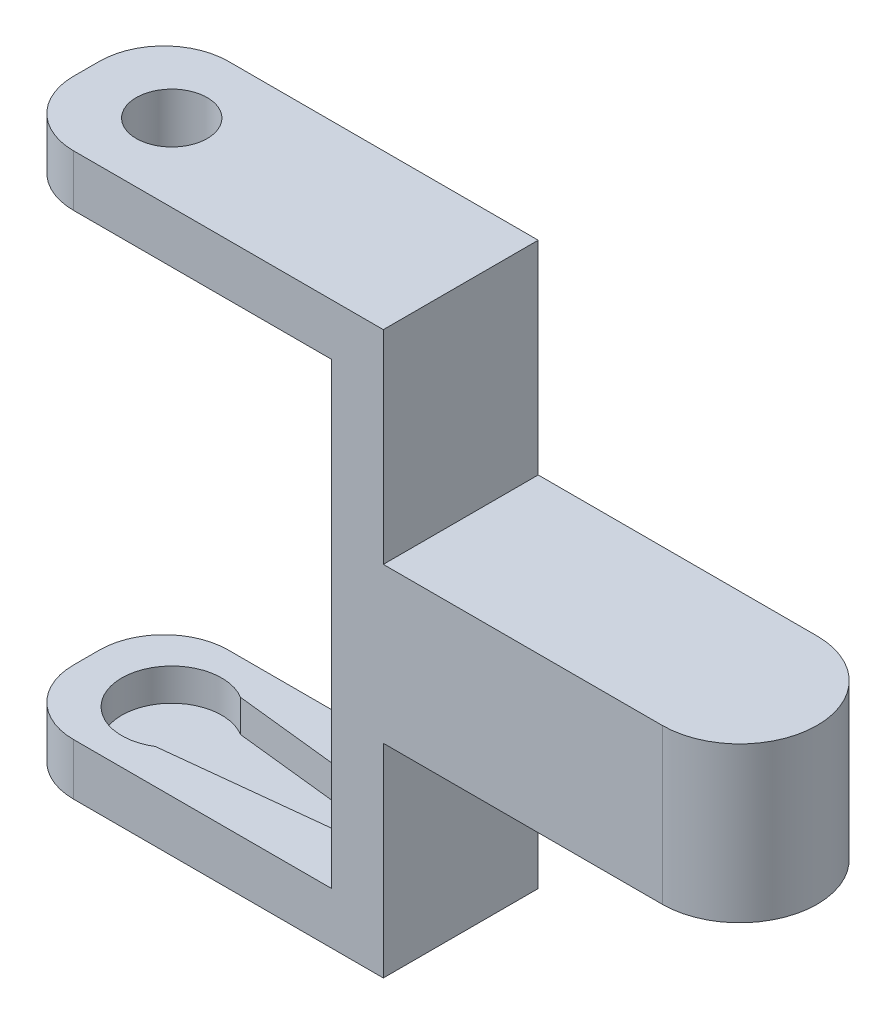
ISO-10303-21;
HEADER;
FILE_DESCRIPTION(('STEP AP214'),'2;1');
FILE_NAME('part.step','',(''),(''),'','','');
FILE_SCHEMA(('AUTOMOTIVE_DESIGN { 1 0 10303 214 1 1 1 1 }'));
ENDSEC;
DATA;
#1=APPLICATION_CONTEXT('core data for automotive mechanical design processes');
#2=APPLICATION_PROTOCOL_DEFINITION('international standard','automotive_design',2000,#1);
#3=PRODUCT_CONTEXT('',#1,'mechanical');
#4=PRODUCT('Part','Part','',(#3));
#5=PRODUCT_RELATED_PRODUCT_CATEGORY('part','',(#4));
#6=PRODUCT_DEFINITION_FORMATION('','',#4);
#7=PRODUCT_DEFINITION_CONTEXT('part definition',#1,'design');
#8=PRODUCT_DEFINITION('design','',#6,#7);
#9=PRODUCT_DEFINITION_SHAPE('','',#8);
#10=(LENGTH_UNIT() NAMED_UNIT(*) SI_UNIT(.MILLI.,.METRE.));
#11=(NAMED_UNIT(*) PLANE_ANGLE_UNIT() SI_UNIT($,.RADIAN.));
#12=(NAMED_UNIT(*) SI_UNIT($,.STERADIAN.) SOLID_ANGLE_UNIT());
#13=UNCERTAINTY_MEASURE_WITH_UNIT(LENGTH_MEASURE(1.E-05),#10,'distance_accuracy_value','');
#14=(GEOMETRIC_REPRESENTATION_CONTEXT(3) GLOBAL_UNCERTAINTY_ASSIGNED_CONTEXT((#13)) GLOBAL_UNIT_ASSIGNED_CONTEXT((#10,
#11,#12)) REPRESENTATION_CONTEXT('',''));
#15=CARTESIAN_POINT('',(0.,0.,0.));
#16=DIRECTION('',(0.,0.,1.));
#17=DIRECTION('',(1.,0.,0.));
#18=AXIS2_PLACEMENT_3D('',#15,#16,#17);
#19=CARTESIAN_POINT('',(44.0008137570343,23.75,0.));
#20=DIRECTION('',(0.,1.,0.));
#21=DIRECTION('',(0.,0.,1.));
#22=AXIS2_PLACEMENT_3D('',#19,#20,#21);
#23=CYLINDRICAL_SURFACE('',#22,6.);
#24=DIRECTION('',(0.,1.,0.));
#25=VECTOR('',#24,1.);
#26=CARTESIAN_POINT('',(44.0008137570343,-4.,-6.));
#27=LINE('',#26,#25);
#28=CARTESIAN_POINT('',(44.0008137570343,23.75,-6.));
#29=VERTEX_POINT('',#28);
#30=CARTESIAN_POINT('',(44.0008137570343,11.75,-6.));
#31=VERTEX_POINT('',#30);
#32=EDGE_CURVE('E175',#29,#31,#27,.F.);
#33=ORIENTED_EDGE('',*,*,#32,.F.);
#34=CARTESIAN_POINT('',(44.0008137570343,23.75,0.));
#35=DIRECTION('',(0.,-1.,0.));
#36=DIRECTION('',(0.,0.,-1.));
#37=AXIS2_PLACEMENT_3D('',#34,#35,#36);
#38=CIRCLE('',#37,6.);
#39=CARTESIAN_POINT('',(44.0008137570343,23.75,6.));
#40=VERTEX_POINT('',#39);
#41=EDGE_CURVE('E43',#40,#29,#38,.F.);
#42=ORIENTED_EDGE('',*,*,#41,.F.);
#43=DIRECTION('',(0.,1.,0.));
#44=VECTOR('',#43,1.);
#45=CARTESIAN_POINT('',(44.0008137570343,-4.,6.));
#46=LINE('',#45,#44);
#47=CARTESIAN_POINT('',(44.0008137570343,11.75,6.));
#48=VERTEX_POINT('',#47);
#49=EDGE_CURVE('E329',#48,#40,#46,.T.);
#50=ORIENTED_EDGE('',*,*,#49,.F.);
#51=CARTESIAN_POINT('',(44.0008137570343,11.75,0.));
#52=DIRECTION('',(0.,1.,0.));
#53=DIRECTION('',(0.,0.,1.));
#54=AXIS2_PLACEMENT_3D('',#51,#52,#53);
#55=CIRCLE('',#54,6.);
#56=EDGE_CURVE('E11',#31,#48,#55,.F.);
#57=ORIENTED_EDGE('',*,*,#56,.F.);
#58=EDGE_LOOP('',(#33,#42,#50,#57));
#59=FACE_BOUND('',#58,.T.);
#60=ADVANCED_FACE('F35',(#59),#23,.T.);
#61=CARTESIAN_POINT('',(22.3908137570343,39.5,6.));
#62=DIRECTION('',(1.,0.,0.));
#63=DIRECTION('',(0.,0.,-1.));
#64=AXIS2_PLACEMENT_3D('',#61,#62,#63);
#65=PLANE('',#64);
#66=DIRECTION('',(0.,0.,1.));
#67=VECTOR('',#66,1.);
#68=CARTESIAN_POINT('',(22.3908137570343,23.75,6.));
#69=LINE('',#68,#67);
#70=CARTESIAN_POINT('',(22.3908137570343,23.75,-6.));
#71=VERTEX_POINT('',#70);
#72=CARTESIAN_POINT('',(22.3908137570343,23.75,6.));
#73=VERTEX_POINT('',#72);
#74=EDGE_CURVE('E193',#71,#73,#69,.T.);
#75=ORIENTED_EDGE('',*,*,#74,.F.);
#76=DIRECTION('',(0.,-1.,0.));
#77=VECTOR('',#76,1.);
#78=CARTESIAN_POINT('',(22.3908137570343,39.5,-6.));
#79=LINE('',#78,#77);
#80=CARTESIAN_POINT('',(22.3908137570343,39.5,-6.));
#81=VERTEX_POINT('',#80);
#82=EDGE_CURVE('E188',#81,#71,#79,.T.);
#83=ORIENTED_EDGE('',*,*,#82,.F.);
#84=DIRECTION('',(0.,0.,1.));
#85=VECTOR('',#84,1.);
#86=CARTESIAN_POINT('',(22.3908137570343,39.5,6.));
#87=LINE('',#86,#85);
#88=CARTESIAN_POINT('',(22.3908137570343,39.5,6.));
#89=VERTEX_POINT('',#88);
#90=EDGE_CURVE('E225',#81,#89,#87,.T.);
#91=ORIENTED_EDGE('',*,*,#90,.T.);
#92=DIRECTION('',(0.,-1.,0.));
#93=VECTOR('',#92,1.);
#94=CARTESIAN_POINT('',(22.3908137570343,39.5,6.));
#95=LINE('',#94,#93);
#96=EDGE_CURVE('E236',#89,#73,#95,.T.);
#97=ORIENTED_EDGE('',*,*,#96,.T.);
#98=EDGE_LOOP('',(#75,#83,#91,#97));
#99=FACE_BOUND('',#98,.T.);
#100=ADVANCED_FACE('F338',(#99),#65,.T.);
#101=CARTESIAN_POINT('',(-6.60918624296569,-4.,-6.));
#102=DIRECTION('',(-1.,0.,0.));
#103=DIRECTION('',(0.,0.,1.));
#104=AXIS2_PLACEMENT_3D('',#101,#102,#103);
#105=PLANE('',#104);
#106=DIRECTION('',(0.,0.,1.));
#107=VECTOR('',#106,1.);
#108=CARTESIAN_POINT('',(-6.60918624296569,-4.,-6.));
#109=LINE('',#108,#107);
#110=CARTESIAN_POINT('',(-6.60918624296569,-4.,-0.999999999999999));
#111=VERTEX_POINT('',#110);
#112=CARTESIAN_POINT('',(-6.60918624296569,-4.,1.));
#113=VERTEX_POINT('',#112);
#114=EDGE_CURVE('E274',#111,#113,#109,.T.);
#115=ORIENTED_EDGE('',*,*,#114,.T.);
#116=DIRECTION('',(0.,1.,0.));
#117=VECTOR('',#116,1.);
#118=CARTESIAN_POINT('',(-6.60918624296569,-4.,1.));
#119=LINE('',#118,#117);
#120=CARTESIAN_POINT('',(-6.60918624296569,0.,1.));
#121=VERTEX_POINT('',#120);
#122=EDGE_CURVE('E317',#113,#121,#119,.T.);
#123=ORIENTED_EDGE('',*,*,#122,.T.);
#124=DIRECTION('',(0.,0.,1.));
#125=VECTOR('',#124,1.);
#126=CARTESIAN_POINT('',(-6.60918624296569,0.,-6.));
#127=LINE('',#126,#125);
#128=CARTESIAN_POINT('',(-6.60918624296569,0.,-0.999999999999999));
#129=VERTEX_POINT('',#128);
#130=EDGE_CURVE('E267',#129,#121,#127,.T.);
#131=ORIENTED_EDGE('',*,*,#130,.F.);
#132=DIRECTION('',(0.,1.,0.));
#133=VECTOR('',#132,1.);
#134=CARTESIAN_POINT('',(-6.60918624296569,-4.,-0.999999999999999));
#135=LINE('',#134,#133);
#136=EDGE_CURVE('E315',#129,#111,#135,.F.);
#137=ORIENTED_EDGE('',*,*,#136,.T.);
#138=EDGE_LOOP('',(#115,#123,#131,#137));
#139=FACE_BOUND('',#138,.T.);
#140=ADVANCED_FACE('F381',(#139),#105,.T.);
#141=CARTESIAN_POINT('',(-6.60918624296569,-4.,-6.));
#142=DIRECTION('',(0.,0.,-1.));
#143=DIRECTION('',(-1.,0.,0.));
#144=AXIS2_PLACEMENT_3D('',#141,#142,#143);
#145=PLANE('',#144);
#146=DIRECTION('',(-1.,0.,0.));
#147=VECTOR('',#146,1.);
#148=CARTESIAN_POINT('',(50.0008137570343,23.75,-6.));
#149=LINE('',#148,#147);
#150=EDGE_CURVE('E178',#29,#71,#149,.T.);
#151=ORIENTED_EDGE('',*,*,#150,.F.);
#152=ORIENTED_EDGE('',*,*,#32,.T.);
#153=DIRECTION('',(-1.,0.,0.));
#154=VECTOR('',#153,1.);
#155=CARTESIAN_POINT('',(50.0008137570343,11.75,-6.));
#156=LINE('',#155,#154);
#157=CARTESIAN_POINT('',(22.3908137570343,11.75,-6.));
#158=VERTEX_POINT('',#157);
#159=EDGE_CURVE('E168',#31,#158,#156,.T.);
#160=ORIENTED_EDGE('',*,*,#159,.T.);
#161=CARTESIAN_POINT('',(22.3908137570343,-4.,-6.));
#162=VERTEX_POINT('',#161);
#163=EDGE_CURVE('E173',#158,#162,#79,.T.);
#164=ORIENTED_EDGE('',*,*,#163,.T.);
#165=DIRECTION('',(-1.,0.,0.));
#166=VECTOR('',#165,1.);
#167=CARTESIAN_POINT('',(-6.60918624296569,-4.,-6.));
#168=LINE('',#167,#166);
#169=CARTESIAN_POINT('',(-1.60918624296569,-4.,-6.));
#170=VERTEX_POINT('',#169);
#171=EDGE_CURVE('E281',#162,#170,#168,.T.);
#172=ORIENTED_EDGE('',*,*,#171,.T.);
#173=DIRECTION('',(0.,1.,0.));
#174=VECTOR('',#173,1.);
#175=CARTESIAN_POINT('',(-1.60918624296569,-4.,-6.));
#176=LINE('',#175,#174);
#177=CARTESIAN_POINT('',(-1.60918624296569,0.,-6.));
#178=VERTEX_POINT('',#177);
#179=EDGE_CURVE('E309',#170,#178,#176,.T.);
#180=ORIENTED_EDGE('',*,*,#179,.T.);
#181=DIRECTION('',(-1.,0.,0.));
#182=VECTOR('',#181,1.);
#183=CARTESIAN_POINT('',(-6.60918624296569,0.,-6.));
#184=LINE('',#183,#182);
#185=CARTESIAN_POINT('',(18.3908137570343,0.,-6.));
#186=VERTEX_POINT('',#185);
#187=EDGE_CURVE('E278',#186,#178,#184,.T.);
#188=ORIENTED_EDGE('',*,*,#187,.F.);
#189=DIRECTION('',(0.,-1.,0.));
#190=VECTOR('',#189,1.);
#191=CARTESIAN_POINT('',(18.3908137570343,39.5,-6.));
#192=LINE('',#191,#190);
#193=CARTESIAN_POINT('',(18.3908137570343,35.5,-6.));
#194=VERTEX_POINT('',#193);
#195=EDGE_CURVE('E189',#194,#186,#192,.T.);
#196=ORIENTED_EDGE('',*,*,#195,.F.);
#197=DIRECTION('',(-1.,0.,0.));
#198=VECTOR('',#197,1.);
#199=CARTESIAN_POINT('',(18.3908137570343,35.5,-6.));
#200=LINE('',#199,#198);
#201=CARTESIAN_POINT('',(-1.60918624296568,35.5,-6.));
#202=VERTEX_POINT('',#201);
#203=EDGE_CURVE('E218',#194,#202,#200,.T.);
#204=ORIENTED_EDGE('',*,*,#203,.T.);
#205=DIRECTION('',(0.,1.,0.));
#206=VECTOR('',#205,1.);
#207=CARTESIAN_POINT('',(-1.60918624296569,-4.,-6.));
#208=LINE('',#207,#206);
#209=CARTESIAN_POINT('',(-1.60918624296568,39.5,-6.));
#210=VERTEX_POINT('',#209);
#211=EDGE_CURVE('E312',#202,#210,#208,.T.);
#212=ORIENTED_EDGE('',*,*,#211,.T.);
#213=DIRECTION('',(1.,0.,0.));
#214=VECTOR('',#213,1.);
#215=CARTESIAN_POINT('',(18.3908137570343,39.5,-6.));
#216=LINE('',#215,#214);
#217=EDGE_CURVE('E223',#210,#81,#216,.T.);
#218=ORIENTED_EDGE('',*,*,#217,.T.);
#219=ORIENTED_EDGE('',*,*,#82,.T.);
#220=EDGE_LOOP('',(#151,#152,#160,#164,#172,#180,#188,#196,#204,#212,#218,#219));
#221=FACE_BOUND('',#220,.T.);
#222=ADVANCED_FACE('F171',(#221),#145,.T.);
#223=CARTESIAN_POINT('',(-6.60918624296569,-4.,6.));
#224=DIRECTION('',(0.,0.,1.));
#225=DIRECTION('',(1.,0.,0.));
#226=AXIS2_PLACEMENT_3D('',#223,#224,#225);
#227=PLANE('',#226);
#228=DIRECTION('',(-1.,0.,0.));
#229=VECTOR('',#228,1.);
#230=CARTESIAN_POINT('',(50.0008137570343,11.75,6.));
#231=LINE('',#230,#229);
#232=CARTESIAN_POINT('',(22.3908137570343,11.75,6.));
#233=VERTEX_POINT('',#232);
#234=EDGE_CURVE('E177',#48,#233,#231,.T.);
#235=ORIENTED_EDGE('',*,*,#234,.F.);
#236=ORIENTED_EDGE('',*,*,#49,.T.);
#237=DIRECTION('',(-1.,0.,0.));
#238=VECTOR('',#237,1.);
#239=CARTESIAN_POINT('',(50.0008137570343,23.75,6.));
#240=LINE('',#239,#238);
#241=EDGE_CURVE('E196',#40,#73,#240,.T.);
#242=ORIENTED_EDGE('',*,*,#241,.T.);
#243=ORIENTED_EDGE('',*,*,#96,.F.);
#244=DIRECTION('',(-1.,0.,0.));
#245=VECTOR('',#244,1.);
#246=CARTESIAN_POINT('',(18.3908137570343,39.5,6.));
#247=LINE('',#246,#245);
#248=CARTESIAN_POINT('',(-1.60918624296568,39.5,6.));
#249=VERTEX_POINT('',#248);
#250=EDGE_CURVE('E228',#89,#249,#247,.T.);
#251=ORIENTED_EDGE('',*,*,#250,.T.);
#252=DIRECTION('',(0.,1.,0.));
#253=VECTOR('',#252,1.);
#254=CARTESIAN_POINT('',(-1.60918624296569,-4.,6.));
#255=LINE('',#254,#253);
#256=CARTESIAN_POINT('',(-1.60918624296568,35.5,6.));
#257=VERTEX_POINT('',#256);
#258=EDGE_CURVE('E303',#249,#257,#255,.F.);
#259=ORIENTED_EDGE('',*,*,#258,.T.);
#260=DIRECTION('',(-1.,0.,0.));
#261=VECTOR('',#260,1.);
#262=CARTESIAN_POINT('',(18.3908137570343,35.5,6.));
#263=LINE('',#262,#261);
#264=CARTESIAN_POINT('',(18.3908137570343,35.5,6.));
#265=VERTEX_POINT('',#264);
#266=EDGE_CURVE('E212',#265,#257,#263,.T.);
#267=ORIENTED_EDGE('',*,*,#266,.F.);
#268=DIRECTION('',(0.,-1.,0.));
#269=VECTOR('',#268,1.);
#270=CARTESIAN_POINT('',(18.3908137570343,39.5,6.));
#271=LINE('',#270,#269);
#272=CARTESIAN_POINT('',(18.3908137570343,0.,6.));
#273=VERTEX_POINT('',#272);
#274=EDGE_CURVE('E232',#265,#273,#271,.T.);
#275=ORIENTED_EDGE('',*,*,#274,.T.);
#276=DIRECTION('',(1.,0.,0.));
#277=VECTOR('',#276,1.);
#278=CARTESIAN_POINT('',(-6.60918624296569,0.,6.));
#279=LINE('',#278,#277);
#280=CARTESIAN_POINT('',(-1.60918624296569,0.,6.));
#281=VERTEX_POINT('',#280);
#282=EDGE_CURVE('E286',#281,#273,#279,.T.);
#283=ORIENTED_EDGE('',*,*,#282,.F.);
#284=DIRECTION('',(0.,1.,0.));
#285=VECTOR('',#284,1.);
#286=CARTESIAN_POINT('',(-1.60918624296569,-4.,6.));
#287=LINE('',#286,#285);
#288=CARTESIAN_POINT('',(-1.60918624296569,-4.,6.));
#289=VERTEX_POINT('',#288);
#290=EDGE_CURVE('E301',#281,#289,#287,.F.);
#291=ORIENTED_EDGE('',*,*,#290,.T.);
#292=DIRECTION('',(1.,0.,0.));
#293=VECTOR('',#292,1.);
#294=CARTESIAN_POINT('',(-6.60918624296569,-4.,6.));
#295=LINE('',#294,#293);
#296=CARTESIAN_POINT('',(22.3908137570343,-4.,6.));
#297=VERTEX_POINT('',#296);
#298=EDGE_CURVE('E277',#289,#297,#295,.T.);
#299=ORIENTED_EDGE('',*,*,#298,.T.);
#300=EDGE_CURVE('E238',#233,#297,#95,.T.);
#301=ORIENTED_EDGE('',*,*,#300,.F.);
#302=EDGE_LOOP('',(#235,#236,#242,#243,#251,#259,#267,#275,#283,#291,#299,#301));
#303=FACE_BOUND('',#302,.T.);
#304=ADVANCED_FACE('F344',(#303),#227,.T.);
#305=CARTESIAN_POINT('',(0.,-4.,0.));
#306=DIRECTION('',(0.,1.,0.));
#307=DIRECTION('',(0.,0.,1.));
#308=AXIS2_PLACEMENT_3D('',#305,#306,#307);
#309=PLANE('',#308);
#310=ORIENTED_EDGE('',*,*,#298,.F.);
#311=CARTESIAN_POINT('',(-1.60918624296569,-4.,1.));
#312=DIRECTION('',(0.,1.,0.));
#313=DIRECTION('',(0.,0.,1.));
#314=AXIS2_PLACEMENT_3D('',#311,#312,#313);
#315=CIRCLE('',#314,5.);
#316=EDGE_CURVE('E326',#289,#113,#315,.F.);
#317=ORIENTED_EDGE('',*,*,#316,.T.);
#318=ORIENTED_EDGE('',*,*,#114,.F.);
#319=CARTESIAN_POINT('',(-1.60918624296569,-4.,-1.));
#320=DIRECTION('',(0.,1.,0.));
#321=DIRECTION('',(0.,0.,1.));
#322=AXIS2_PLACEMENT_3D('',#319,#320,#321);
#323=CIRCLE('',#322,5.);
#324=EDGE_CURVE('E324',#111,#170,#323,.F.);
#325=ORIENTED_EDGE('',*,*,#324,.T.);
#326=ORIENTED_EDGE('',*,*,#171,.F.);
#327=DIRECTION('',(0.,0.,1.));
#328=VECTOR('',#327,1.);
#329=CARTESIAN_POINT('',(22.3908137570343,-4.,6.));
#330=LINE('',#329,#328);
#331=EDGE_CURVE('E187',#162,#297,#330,.T.);
#332=ORIENTED_EDGE('',*,*,#331,.T.);
#333=EDGE_LOOP('',(#310,#317,#318,#325,#326,#332));
#334=FACE_BOUND('',#333,.T.);
#335=ADVANCED_FACE('F378',(#334),#309,.F.);
#336=CARTESIAN_POINT('',(0.,0.,0.));
#337=DIRECTION('',(0.,1.,0.));
#338=DIRECTION('',(0.,0.,1.));
#339=AXIS2_PLACEMENT_3D('',#336,#337,#338);
#340=PLANE('',#339);
#341=CARTESIAN_POINT('',(14.254126853945,0.,0.));
#342=DIRECTION('',(0.,1.,0.));
#343=DIRECTION('',(0.,0.,1.));
#344=AXIS2_PLACEMENT_3D('',#341,#342,#343);
#345=CIRCLE('',#344,1.96240815597465);
#346=CARTESIAN_POINT('',(14.254126853945,0.,1.96240815597465));
#347=VERTEX_POINT('',#346);
#348=CARTESIAN_POINT('',(14.254126853945,0.,-1.96240815597465));
#349=VERTEX_POINT('',#348);
#350=EDGE_CURVE('E235',#347,#349,#345,.T.);
#351=ORIENTED_EDGE('',*,*,#350,.F.);
#352=DIRECTION('',(0.994069597814504,0.,-0.108745734173391));
#353=VECTOR('',#352,1.);
#354=CARTESIAN_POINT('',(14.254126853945,0.,1.96240815597465));
#355=LINE('',#354,#353);
#356=CARTESIAN_POINT('',(2.0290903736251,0.,3.29975975617614));
#357=VERTEX_POINT('',#356);
#358=EDGE_CURVE('E246',#357,#347,#355,.T.);
#359=ORIENTED_EDGE('',*,*,#358,.F.);
#360=CARTESIAN_POINT('',(0.,0.,0.));
#361=DIRECTION('',(0.,1.,0.));
#362=DIRECTION('',(0.,0.,1.));
#363=AXIS2_PLACEMENT_3D('',#360,#361,#362);
#364=CIRCLE('',#363,3.87370910018004);
#365=CARTESIAN_POINT('',(2.0290903736251,0.,-3.29975975617614));
#366=VERTEX_POINT('',#365);
#367=EDGE_CURVE('E260',#366,#357,#364,.T.);
#368=ORIENTED_EDGE('',*,*,#367,.F.);
#369=DIRECTION('',(-0.994069597814504,0.,-0.108745734173391));
#370=VECTOR('',#369,1.);
#371=CARTESIAN_POINT('',(14.254126853945,0.,-1.96240815597465));
#372=LINE('',#371,#370);
#373=EDGE_CURVE('E257',#349,#366,#372,.T.);
#374=ORIENTED_EDGE('',*,*,#373,.F.);
#375=EDGE_LOOP('',(#351,#359,#368,#374));
#376=FACE_BOUND('',#375,.T.);
#377=ORIENTED_EDGE('',*,*,#130,.T.);
#378=CARTESIAN_POINT('',(-1.60918624296569,0.,1.));
#379=DIRECTION('',(0.,1.,0.));
#380=DIRECTION('',(0.,0.,1.));
#381=AXIS2_PLACEMENT_3D('',#378,#379,#380);
#382=CIRCLE('',#381,5.);
#383=EDGE_CURVE('E322',#121,#281,#382,.T.);
#384=ORIENTED_EDGE('',*,*,#383,.T.);
#385=ORIENTED_EDGE('',*,*,#282,.T.);
#386=DIRECTION('',(0.,0.,-1.));
#387=VECTOR('',#386,1.);
#388=CARTESIAN_POINT('',(18.3908137570343,0.,-6.));
#389=LINE('',#388,#387);
#390=EDGE_CURVE('E288',#273,#186,#389,.T.);
#391=ORIENTED_EDGE('',*,*,#390,.T.);
#392=ORIENTED_EDGE('',*,*,#187,.T.);
#393=CARTESIAN_POINT('',(-1.60918624296569,0.,-1.));
#394=DIRECTION('',(0.,1.,0.));
#395=DIRECTION('',(0.,0.,1.));
#396=AXIS2_PLACEMENT_3D('',#393,#394,#395);
#397=CIRCLE('',#396,5.);
#398=EDGE_CURVE('E320',#178,#129,#397,.T.);
#399=ORIENTED_EDGE('',*,*,#398,.T.);
#400=EDGE_LOOP('',(#377,#384,#385,#391,#392,#399));
#401=FACE_BOUND('',#400,.T.);
#402=ADVANCED_FACE('F368',(#376,#401),#340,.T.);
#403=CARTESIAN_POINT('',(14.254126853945,-2.5,0.));
#404=DIRECTION('',(0.,1.,0.));
#405=DIRECTION('',(0.,0.,1.));
#406=AXIS2_PLACEMENT_3D('',#403,#404,#405);
#407=CYLINDRICAL_SURFACE('',#406,1.96240815597465);
#408=ORIENTED_EDGE('',*,*,#350,.T.);
#409=DIRECTION('',(0.,1.,0.));
#410=VECTOR('',#409,1.);
#411=CARTESIAN_POINT('',(14.254126853945,-2.5,-1.96240815597465));
#412=LINE('',#411,#410);
#413=CARTESIAN_POINT('',(14.254126853945,-2.5,-1.96240815597465));
#414=VERTEX_POINT('',#413);
#415=EDGE_CURVE('E255',#414,#349,#412,.T.);
#416=ORIENTED_EDGE('',*,*,#415,.F.);
#417=CARTESIAN_POINT('',(14.254126853945,-2.5,0.));
#418=DIRECTION('',(0.,1.,0.));
#419=DIRECTION('',(0.,0.,1.));
#420=AXIS2_PLACEMENT_3D('',#417,#418,#419);
#421=CIRCLE('',#420,1.96240815597465);
#422=CARTESIAN_POINT('',(14.254126853945,-2.5,1.96240815597465));
#423=VERTEX_POINT('',#422);
#424=EDGE_CURVE('E242',#423,#414,#421,.T.);
#425=ORIENTED_EDGE('',*,*,#424,.F.);
#426=DIRECTION('',(0.,1.,0.));
#427=VECTOR('',#426,1.);
#428=CARTESIAN_POINT('',(14.254126853945,-2.5,1.96240815597465));
#429=LINE('',#428,#427);
#430=EDGE_CURVE('E265',#423,#347,#429,.T.);
#431=ORIENTED_EDGE('',*,*,#430,.T.);
#432=EDGE_LOOP('',(#408,#416,#425,#431));
#433=FACE_BOUND('',#432,.T.);
#434=ADVANCED_FACE('F423',(#433),#407,.F.);
#435=CARTESIAN_POINT('',(14.254126853945,-2.5,1.96240815597465));
#436=DIRECTION('',(0.108745734173391,0.,0.994069597814504));
#437=DIRECTION('',(0.994069597814504,0.,-0.108745734173391));
#438=AXIS2_PLACEMENT_3D('',#435,#436,#437);
#439=PLANE('',#438);
#440=ORIENTED_EDGE('',*,*,#358,.T.);
#441=ORIENTED_EDGE('',*,*,#430,.F.);
#442=DIRECTION('',(0.994069597814504,0.,-0.108745734173391));
#443=VECTOR('',#442,1.);
#444=CARTESIAN_POINT('',(14.254126853945,-2.5,1.96240815597465));
#445=LINE('',#444,#443);
#446=CARTESIAN_POINT('',(2.0290903736251,-2.5,3.29975975617614));
#447=VERTEX_POINT('',#446);
#448=EDGE_CURVE('E252',#447,#423,#445,.T.);
#449=ORIENTED_EDGE('',*,*,#448,.F.);
#450=DIRECTION('',(0.,1.,0.));
#451=VECTOR('',#450,1.);
#452=CARTESIAN_POINT('',(2.0290903736251,-2.5,3.29975975617614));
#453=LINE('',#452,#451);
#454=EDGE_CURVE('E268',#447,#357,#453,.T.);
#455=ORIENTED_EDGE('',*,*,#454,.T.);
#456=EDGE_LOOP('',(#440,#441,#449,#455));
#457=FACE_BOUND('',#456,.T.);
#458=ADVANCED_FACE('F419',(#457),#439,.F.);
#459=CARTESIAN_POINT('',(0.,-2.5,0.));
#460=DIRECTION('',(0.,1.,0.));
#461=DIRECTION('',(0.,0.,1.));
#462=AXIS2_PLACEMENT_3D('',#459,#460,#461);
#463=CYLINDRICAL_SURFACE('',#462,3.87370910018004);
#464=ORIENTED_EDGE('',*,*,#367,.T.);
#465=ORIENTED_EDGE('',*,*,#454,.F.);
#466=CARTESIAN_POINT('',(0.,-2.5,0.));
#467=DIRECTION('',(0.,1.,0.));
#468=DIRECTION('',(0.,0.,1.));
#469=AXIS2_PLACEMENT_3D('',#466,#467,#468);
#470=CIRCLE('',#469,3.87370910018004);
#471=CARTESIAN_POINT('',(2.0290903736251,-2.5,-3.29975975617614));
#472=VERTEX_POINT('',#471);
#473=EDGE_CURVE('E249',#472,#447,#470,.T.);
#474=ORIENTED_EDGE('',*,*,#473,.F.);
#475=DIRECTION('',(0.,1.,0.));
#476=VECTOR('',#475,1.);
#477=CARTESIAN_POINT('',(2.0290903736251,-2.5,-3.29975975617614));
#478=LINE('',#477,#476);
#479=EDGE_CURVE('E270',#472,#366,#478,.T.);
#480=ORIENTED_EDGE('',*,*,#479,.T.);
#481=EDGE_LOOP('',(#464,#465,#474,#480));
#482=FACE_BOUND('',#481,.T.);
#483=ADVANCED_FACE('F422',(#482),#463,.F.);
#484=CARTESIAN_POINT('',(14.254126853945,-2.5,-1.96240815597465));
#485=DIRECTION('',(0.108745734173391,0.,-0.994069597814504));
#486=DIRECTION('',(-0.994069597814504,0.,-0.108745734173391));
#487=AXIS2_PLACEMENT_3D('',#484,#485,#486);
#488=PLANE('',#487);
#489=ORIENTED_EDGE('',*,*,#373,.T.);
#490=ORIENTED_EDGE('',*,*,#479,.F.);
#491=DIRECTION('',(-0.994069597814504,0.,-0.108745734173391));
#492=VECTOR('',#491,1.);
#493=CARTESIAN_POINT('',(14.254126853945,-2.5,-1.96240815597465));
#494=LINE('',#493,#492);
#495=EDGE_CURVE('E245',#414,#472,#494,.T.);
#496=ORIENTED_EDGE('',*,*,#495,.F.);
#497=ORIENTED_EDGE('',*,*,#415,.T.);
#498=EDGE_LOOP('',(#489,#490,#496,#497));
#499=FACE_BOUND('',#498,.T.);
#500=ADVANCED_FACE('F415',(#499),#488,.F.);
#501=CARTESIAN_POINT('',(14.254126853945,-2.5,0.));
#502=DIRECTION('',(0.,1.,0.));
#503=DIRECTION('',(0.,0.,1.));
#504=AXIS2_PLACEMENT_3D('',#501,#502,#503);
#505=PLANE('',#504);
#506=ORIENTED_EDGE('',*,*,#424,.T.);
#507=ORIENTED_EDGE('',*,*,#495,.T.);
#508=ORIENTED_EDGE('',*,*,#473,.T.);
#509=ORIENTED_EDGE('',*,*,#448,.T.);
#510=EDGE_LOOP('',(#506,#507,#508,#509));
#511=FACE_BOUND('',#510,.T.);
#512=ADVANCED_FACE('F411',(#511),#505,.T.);
#513=CARTESIAN_POINT('',(18.3908137570343,39.5,6.));
#514=DIRECTION('',(-1.,0.,0.));
#515=DIRECTION('',(0.,0.,1.));
#516=AXIS2_PLACEMENT_3D('',#513,#514,#515);
#517=PLANE('',#516);
#518=DIRECTION('',(0.,0.,1.));
#519=VECTOR('',#518,1.);
#520=CARTESIAN_POINT('',(18.3908137570343,35.5,-6.));
#521=LINE('',#520,#519);
#522=EDGE_CURVE('E209',#194,#265,#521,.T.);
#523=ORIENTED_EDGE('',*,*,#522,.F.);
#524=ORIENTED_EDGE('',*,*,#195,.T.);
#525=ORIENTED_EDGE('',*,*,#390,.F.);
#526=ORIENTED_EDGE('',*,*,#274,.F.);
#527=EDGE_LOOP('',(#523,#524,#525,#526));
#528=FACE_BOUND('',#527,.T.);
#529=ADVANCED_FACE('F366',(#528),#517,.T.);
#530=DIRECTION('',(0.,0.,-1.));
#531=VECTOR('',#530,1.);
#532=CARTESIAN_POINT('',(22.3908137570343,11.75,6.));
#533=LINE('',#532,#531);
#534=EDGE_CURVE('E184',#233,#158,#533,.T.);
#535=ORIENTED_EDGE('',*,*,#534,.F.);
#536=ORIENTED_EDGE('',*,*,#300,.T.);
#537=ORIENTED_EDGE('',*,*,#331,.F.);
#538=ORIENTED_EDGE('',*,*,#163,.F.);
#539=EDGE_LOOP('',(#535,#536,#537,#538));
#540=FACE_BOUND('',#539,.T.);
#541=ADVANCED_FACE('F183',(#540),#65,.T.);
#542=CARTESIAN_POINT('',(0.,39.5,0.));
#543=DIRECTION('',(0.,-1.,0.));
#544=DIRECTION('',(0.,0.,-1.));
#545=AXIS2_PLACEMENT_3D('',#542,#543,#544);
#546=PLANE('',#545);
#547=CARTESIAN_POINT('',(0.,39.5,0.));
#548=DIRECTION('',(0.,1.,0.));
#549=DIRECTION('',(0.,0.,1.));
#550=AXIS2_PLACEMENT_3D('',#547,#548,#549);
#551=CIRCLE('',#550,2.75);
#552=CARTESIAN_POINT('',(0.,39.5,2.75));
#553=VERTEX_POINT('',#552);
#554=EDGE_CURVE('E202',#553,#553,#551,.T.);
#555=ORIENTED_EDGE('',*,*,#554,.F.);
#556=EDGE_LOOP('',(#555));
#557=FACE_BOUND('',#556,.T.);
#558=DIRECTION('',(0.,0.,1.));
#559=VECTOR('',#558,1.);
#560=CARTESIAN_POINT('',(-6.60918624296569,39.5,-6.));
#561=LINE('',#560,#559);
#562=CARTESIAN_POINT('',(-6.60918624296569,39.5,-1.));
#563=VERTEX_POINT('',#562);
#564=CARTESIAN_POINT('',(-6.60918624296569,39.5,1.));
#565=VERTEX_POINT('',#564);
#566=EDGE_CURVE('E206',#563,#565,#561,.T.);
#567=ORIENTED_EDGE('',*,*,#566,.T.);
#568=CARTESIAN_POINT('',(-1.60918624296569,39.5,1.));
#569=DIRECTION('',(0.,-1.,0.));
#570=DIRECTION('',(0.,0.,-1.));
#571=AXIS2_PLACEMENT_3D('',#568,#569,#570);
#572=CIRCLE('',#571,5.);
#573=EDGE_CURVE('E299',#565,#249,#572,.F.);
#574=ORIENTED_EDGE('',*,*,#573,.T.);
#575=ORIENTED_EDGE('',*,*,#250,.F.);
#576=ORIENTED_EDGE('',*,*,#90,.F.);
#577=ORIENTED_EDGE('',*,*,#217,.F.);
#578=CARTESIAN_POINT('',(-1.60918624296569,39.5,-1.));
#579=DIRECTION('',(0.,-1.,0.));
#580=DIRECTION('',(0.,0.,-1.));
#581=AXIS2_PLACEMENT_3D('',#578,#579,#580);
#582=CIRCLE('',#581,5.);
#583=EDGE_CURVE('E297',#210,#563,#582,.F.);
#584=ORIENTED_EDGE('',*,*,#583,.T.);
#585=EDGE_LOOP('',(#567,#574,#575,#576,#577,#584));
#586=FACE_BOUND('',#585,.T.);
#587=ADVANCED_FACE('F341',(#557,#586),#546,.F.);
#588=CARTESIAN_POINT('',(-6.60918624296569,35.5,-6.));
#589=DIRECTION('',(-1.,0.,0.));
#590=DIRECTION('',(0.,0.,1.));
#591=AXIS2_PLACEMENT_3D('',#588,#589,#590);
#592=PLANE('',#591);
#593=DIRECTION('',(0.,0.,1.));
#594=VECTOR('',#593,1.);
#595=CARTESIAN_POINT('',(-6.60918624296569,35.5,-6.));
#596=LINE('',#595,#594);
#597=CARTESIAN_POINT('',(-6.60918624296569,35.5,-1.));
#598=VERTEX_POINT('',#597);
#599=CARTESIAN_POINT('',(-6.60918624296569,35.5,1.));
#600=VERTEX_POINT('',#599);
#601=EDGE_CURVE('E215',#598,#600,#596,.T.);
#602=ORIENTED_EDGE('',*,*,#601,.T.);
#603=DIRECTION('',(0.,1.,0.));
#604=VECTOR('',#603,1.);
#605=CARTESIAN_POINT('',(-6.60918624296569,35.5,1.));
#606=LINE('',#605,#604);
#607=EDGE_CURVE('E294',#600,#565,#606,.T.);
#608=ORIENTED_EDGE('',*,*,#607,.T.);
#609=ORIENTED_EDGE('',*,*,#566,.F.);
#610=DIRECTION('',(0.,1.,0.));
#611=VECTOR('',#610,1.);
#612=CARTESIAN_POINT('',(-6.60918624296569,35.5,-1.));
#613=LINE('',#612,#611);
#614=EDGE_CURVE('E283',#563,#598,#613,.F.);
#615=ORIENTED_EDGE('',*,*,#614,.T.);
#616=EDGE_LOOP('',(#602,#608,#609,#615));
#617=FACE_BOUND('',#616,.T.);
#618=ADVANCED_FACE('F355',(#617),#592,.T.);
#619=CARTESIAN_POINT('',(0.,35.5,0.));
#620=DIRECTION('',(0.,-1.,0.));
#621=DIRECTION('',(0.,0.,-1.));
#622=AXIS2_PLACEMENT_3D('',#619,#620,#621);
#623=PLANE('',#622);
#624=CARTESIAN_POINT('',(0.,35.5,0.));
#625=DIRECTION('',(0.,1.,0.));
#626=DIRECTION('',(0.,0.,1.));
#627=AXIS2_PLACEMENT_3D('',#624,#625,#626);
#628=CIRCLE('',#627,2.75);
#629=CARTESIAN_POINT('',(0.,35.5,2.75));
#630=VERTEX_POINT('',#629);
#631=EDGE_CURVE('E203',#630,#630,#628,.T.);
#632=ORIENTED_EDGE('',*,*,#631,.T.);
#633=EDGE_LOOP('',(#632));
#634=FACE_BOUND('',#633,.T.);
#635=ORIENTED_EDGE('',*,*,#266,.T.);
#636=CARTESIAN_POINT('',(-1.60918624296569,35.5,1.));
#637=DIRECTION('',(0.,-1.,0.));
#638=DIRECTION('',(0.,0.,-1.));
#639=AXIS2_PLACEMENT_3D('',#636,#637,#638);
#640=CIRCLE('',#639,5.);
#641=EDGE_CURVE('E307',#257,#600,#640,.T.);
#642=ORIENTED_EDGE('',*,*,#641,.T.);
#643=ORIENTED_EDGE('',*,*,#601,.F.);
#644=CARTESIAN_POINT('',(-1.60918624296569,35.5,-1.));
#645=DIRECTION('',(0.,-1.,0.));
#646=DIRECTION('',(0.,0.,-1.));
#647=AXIS2_PLACEMENT_3D('',#644,#645,#646);
#648=CIRCLE('',#647,5.);
#649=EDGE_CURVE('E305',#598,#202,#648,.T.);
#650=ORIENTED_EDGE('',*,*,#649,.T.);
#651=ORIENTED_EDGE('',*,*,#203,.F.);
#652=ORIENTED_EDGE('',*,*,#522,.T.);
#653=EDGE_LOOP('',(#635,#642,#643,#650,#651,#652));
#654=FACE_BOUND('',#653,.T.);
#655=ADVANCED_FACE('F352',(#634,#654),#623,.T.);
#656=CARTESIAN_POINT('',(0.,35.5,0.));
#657=DIRECTION('',(0.,1.,0.));
#658=DIRECTION('',(0.,0.,1.));
#659=AXIS2_PLACEMENT_3D('',#656,#657,#658);
#660=CYLINDRICAL_SURFACE('',#659,2.75);
#661=ORIENTED_EDGE('',*,*,#631,.F.);
#662=EDGE_LOOP('',(#661));
#663=FACE_BOUND('',#662,.T.);
#664=ORIENTED_EDGE('',*,*,#554,.T.);
#665=EDGE_LOOP('',(#664));
#666=FACE_BOUND('',#665,.T.);
#667=ADVANCED_FACE('F445',(#663,#666),#660,.F.);
#668=CARTESIAN_POINT('',(-1.60918624296569,35.5,1.));
#669=DIRECTION('',(0.,1.,0.));
#670=DIRECTION('',(0.,0.,1.));
#671=AXIS2_PLACEMENT_3D('',#668,#669,#670);
#672=CYLINDRICAL_SURFACE('',#671,5.);
#673=ORIENTED_EDGE('',*,*,#641,.F.);
#674=ORIENTED_EDGE('',*,*,#258,.F.);
#675=ORIENTED_EDGE('',*,*,#573,.F.);
#676=ORIENTED_EDGE('',*,*,#607,.F.);
#677=EDGE_LOOP('',(#673,#674,#675,#676));
#678=FACE_BOUND('',#677,.T.);
#679=ADVANCED_FACE('F348',(#678),#672,.T.);
#680=CARTESIAN_POINT('',(-1.60918624296569,-4.,-1.));
#681=DIRECTION('',(0.,1.,0.));
#682=DIRECTION('',(0.,0.,1.));
#683=AXIS2_PLACEMENT_3D('',#680,#681,#682);
#684=CYLINDRICAL_SURFACE('',#683,5.);
#685=ORIENTED_EDGE('',*,*,#649,.F.);
#686=ORIENTED_EDGE('',*,*,#614,.F.);
#687=ORIENTED_EDGE('',*,*,#583,.F.);
#688=ORIENTED_EDGE('',*,*,#211,.F.);
#689=EDGE_LOOP('',(#685,#686,#687,#688));
#690=FACE_BOUND('',#689,.T.);
#691=ADVANCED_FACE('F359',(#690),#684,.T.);
#692=CARTESIAN_POINT('',(-1.60918624296569,-4.,1.));
#693=DIRECTION('',(0.,1.,0.));
#694=DIRECTION('',(0.,0.,1.));
#695=AXIS2_PLACEMENT_3D('',#692,#693,#694);
#696=CYLINDRICAL_SURFACE('',#695,5.);
#697=ORIENTED_EDGE('',*,*,#316,.F.);
#698=ORIENTED_EDGE('',*,*,#290,.F.);
#699=ORIENTED_EDGE('',*,*,#383,.F.);
#700=ORIENTED_EDGE('',*,*,#122,.F.);
#701=EDGE_LOOP('',(#697,#698,#699,#700));
#702=FACE_BOUND('',#701,.T.);
#703=ADVANCED_FACE('F374',(#702),#696,.T.);
#704=CARTESIAN_POINT('',(-1.60918624296569,-4.,-1.));
#705=DIRECTION('',(0.,1.,0.));
#706=DIRECTION('',(0.,0.,1.));
#707=AXIS2_PLACEMENT_3D('',#704,#705,#706);
#708=CYLINDRICAL_SURFACE('',#707,5.);
#709=ORIENTED_EDGE('',*,*,#324,.F.);
#710=ORIENTED_EDGE('',*,*,#136,.F.);
#711=ORIENTED_EDGE('',*,*,#398,.F.);
#712=ORIENTED_EDGE('',*,*,#179,.F.);
#713=EDGE_LOOP('',(#709,#710,#711,#712));
#714=FACE_BOUND('',#713,.T.);
#715=ADVANCED_FACE('F385',(#714),#708,.T.);
#716=CARTESIAN_POINT('',(50.0008137570343,11.75,6.));
#717=DIRECTION('',(0.,1.,0.));
#718=DIRECTION('',(0.,0.,1.));
#719=AXIS2_PLACEMENT_3D('',#716,#717,#718);
#720=PLANE('',#719);
#721=ORIENTED_EDGE('',*,*,#159,.F.);
#722=ORIENTED_EDGE('',*,*,#56,.T.);
#723=ORIENTED_EDGE('',*,*,#234,.T.);
#724=ORIENTED_EDGE('',*,*,#534,.T.);
#725=EDGE_LOOP('',(#721,#722,#723,#724));
#726=FACE_BOUND('',#725,.T.);
#727=ADVANCED_FACE('F191',(#726),#720,.F.);
#728=CARTESIAN_POINT('',(50.0008137570343,23.75,6.));
#729=DIRECTION('',(0.,-1.,0.));
#730=DIRECTION('',(0.,0.,-1.));
#731=AXIS2_PLACEMENT_3D('',#728,#729,#730);
#732=PLANE('',#731);
#733=ORIENTED_EDGE('',*,*,#241,.F.);
#734=ORIENTED_EDGE('',*,*,#41,.T.);
#735=ORIENTED_EDGE('',*,*,#150,.T.);
#736=ORIENTED_EDGE('',*,*,#74,.T.);
#737=EDGE_LOOP('',(#733,#734,#735,#736));
#738=FACE_BOUND('',#737,.T.);
#739=ADVANCED_FACE('F332',(#738),#732,.F.);
#740=CLOSED_SHELL('',(#60,#100,#140,#222,#304,#335,#402,#434,#458,#483,#500,#512,#529,#541,#587,
#618,#655,#667,#679,#691,#703,#715,#727,#739));
#741=MANIFOLD_SOLID_BREP('B2',#740);
#742=ADVANCED_BREP_SHAPE_REPRESENTATION('',(#18,#741),#14);
#743=SHAPE_DEFINITION_REPRESENTATION(#9,#742);
ENDSEC;
END-ISO-10303-21;
